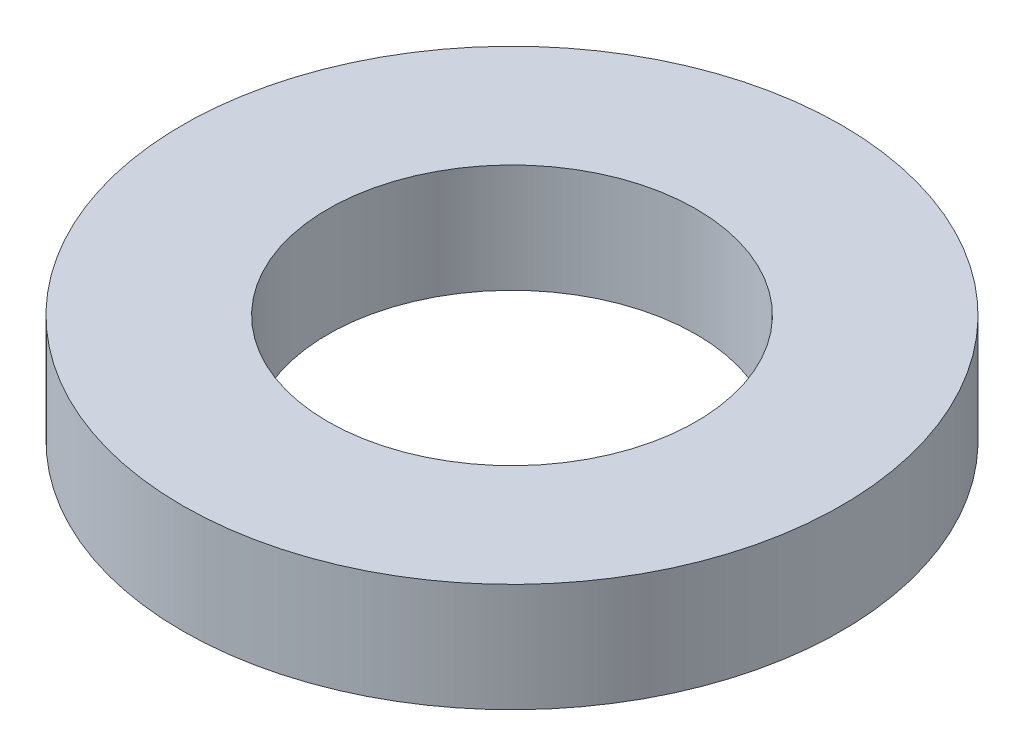
ISO-10303-21;
HEADER;
FILE_DESCRIPTION(('STEP AP214'),'2;1');
FILE_NAME('part.step','',(''),(''),'','','');
FILE_SCHEMA(('AUTOMOTIVE_DESIGN { 1 0 10303 214 1 1 1 1 }'));
ENDSEC;
DATA;
#1=APPLICATION_CONTEXT('core data for automotive mechanical design processes');
#2=APPLICATION_PROTOCOL_DEFINITION('international standard','automotive_design',2000,#1);
#3=PRODUCT_CONTEXT('',#1,'mechanical');
#4=PRODUCT('Part','Part','',(#3));
#5=PRODUCT_RELATED_PRODUCT_CATEGORY('part','',(#4));
#6=PRODUCT_DEFINITION_FORMATION('','',#4);
#7=PRODUCT_DEFINITION_CONTEXT('part definition',#1,'design');
#8=PRODUCT_DEFINITION('design','',#6,#7);
#9=PRODUCT_DEFINITION_SHAPE('','',#8);
#10=(LENGTH_UNIT() NAMED_UNIT(*) SI_UNIT(.MILLI.,.METRE.));
#11=(NAMED_UNIT(*) PLANE_ANGLE_UNIT() SI_UNIT($,.RADIAN.));
#12=(NAMED_UNIT(*) SI_UNIT($,.STERADIAN.) SOLID_ANGLE_UNIT());
#13=UNCERTAINTY_MEASURE_WITH_UNIT(LENGTH_MEASURE(1.E-05),#10,'distance_accuracy_value','');
#14=(GEOMETRIC_REPRESENTATION_CONTEXT(3) GLOBAL_UNCERTAINTY_ASSIGNED_CONTEXT((#13)) GLOBAL_UNIT_ASSIGNED_CONTEXT((#10,
#11,#12)) REPRESENTATION_CONTEXT('',''));
#15=CARTESIAN_POINT('',(0.,0.,0.));
#16=DIRECTION('',(0.,0.,1.));
#17=DIRECTION('',(1.,0.,0.));
#18=AXIS2_PLACEMENT_3D('',#15,#16,#17);
#19=CARTESIAN_POINT('',(0.,28.,0.));
#20=DIRECTION('',(0.,-1.,0.));
#21=DIRECTION('',(0.,0.,-1.));
#22=AXIS2_PLACEMENT_3D('',#19,#20,#21);
#23=CYLINDRICAL_SURFACE('',#22,85.);
#24=CARTESIAN_POINT('',(0.,28.,0.));
#25=DIRECTION('',(0.,1.,0.));
#26=DIRECTION('',(0.,0.,1.));
#27=AXIS2_PLACEMENT_3D('',#24,#25,#26);
#28=CIRCLE('',#27,85.);
#29=CARTESIAN_POINT('',(0.,28.,85.));
#30=VERTEX_POINT('',#29);
#31=EDGE_CURVE('E10',#30,#30,#28,.T.);
#32=ORIENTED_EDGE('',*,*,#31,.F.);
#33=EDGE_LOOP('',(#32));
#34=FACE_BOUND('',#33,.T.);
#35=CARTESIAN_POINT('',(0.,0.,0.));
#36=DIRECTION('',(0.,1.,0.));
#37=DIRECTION('',(0.,0.,1.));
#38=AXIS2_PLACEMENT_3D('',#35,#36,#37);
#39=CIRCLE('',#38,85.);
#40=CARTESIAN_POINT('',(0.,0.,85.));
#41=VERTEX_POINT('',#40);
#42=EDGE_CURVE('E37',#41,#41,#39,.T.);
#43=ORIENTED_EDGE('',*,*,#42,.T.);
#44=EDGE_LOOP('',(#43));
#45=FACE_BOUND('',#44,.T.);
#46=ADVANCED_FACE('F40',(#34,#45),#23,.T.);
#47=CARTESIAN_POINT('',(0.,28.,0.));
#48=DIRECTION('',(0.,1.,0.));
#49=DIRECTION('',(0.,0.,1.));
#50=AXIS2_PLACEMENT_3D('',#47,#48,#49);
#51=PLANE('',#50);
#52=CARTESIAN_POINT('',(0.,28.,0.));
#53=DIRECTION('',(0.,1.,0.));
#54=DIRECTION('',(0.,0.,1.));
#55=AXIS2_PLACEMENT_3D('',#52,#53,#54);
#56=CIRCLE('',#55,47.5);
#57=CARTESIAN_POINT('',(0.,28.,47.5));
#58=VERTEX_POINT('',#57);
#59=EDGE_CURVE('E50',#58,#58,#56,.T.);
#60=ORIENTED_EDGE('',*,*,#59,.F.);
#61=EDGE_LOOP('',(#60));
#62=FACE_BOUND('',#61,.T.);
#63=ORIENTED_EDGE('',*,*,#31,.T.);
#64=EDGE_LOOP('',(#63));
#65=FACE_BOUND('',#64,.T.);
#66=ADVANCED_FACE('F59',(#62,#65),#51,.T.);
#67=CARTESIAN_POINT('',(0.,0.,0.));
#68=DIRECTION('',(0.,1.,0.));
#69=DIRECTION('',(0.,0.,1.));
#70=AXIS2_PLACEMENT_3D('',#67,#68,#69);
#71=PLANE('',#70);
#72=CARTESIAN_POINT('',(0.,0.,0.));
#73=DIRECTION('',(0.,1.,0.));
#74=DIRECTION('',(0.,0.,1.));
#75=AXIS2_PLACEMENT_3D('',#72,#73,#74);
#76=CIRCLE('',#75,47.5);
#77=CARTESIAN_POINT('',(0.,0.,47.5));
#78=VERTEX_POINT('',#77);
#79=EDGE_CURVE('E47',#78,#78,#76,.T.);
#80=ORIENTED_EDGE('',*,*,#79,.T.);
#81=EDGE_LOOP('',(#80));
#82=FACE_BOUND('',#81,.T.);
#83=ORIENTED_EDGE('',*,*,#42,.F.);
#84=EDGE_LOOP('',(#83));
#85=FACE_BOUND('',#84,.T.);
#86=ADVANCED_FACE('F58',(#82,#85),#71,.F.);
#87=CARTESIAN_POINT('',(0.,28.,0.));
#88=DIRECTION('',(0.,-1.,0.));
#89=DIRECTION('',(0.,0.,-1.));
#90=AXIS2_PLACEMENT_3D('',#87,#88,#89);
#91=CYLINDRICAL_SURFACE('',#90,47.5);
#92=ORIENTED_EDGE('',*,*,#59,.T.);
#93=EDGE_LOOP('',(#92));
#94=FACE_BOUND('',#93,.T.);
#95=ORIENTED_EDGE('',*,*,#79,.F.);
#96=EDGE_LOOP('',(#95));
#97=FACE_BOUND('',#96,.T.);
#98=ADVANCED_FACE('F54',(#94,#97),#91,.F.);
#99=CLOSED_SHELL('',(#46,#66,#86,#98));
#100=MANIFOLD_SOLID_BREP('B2',#99);
#101=ADVANCED_BREP_SHAPE_REPRESENTATION('',(#18,#100),#14);
#102=SHAPE_DEFINITION_REPRESENTATION(#9,#101);
ENDSEC;
END-ISO-10303-21;
